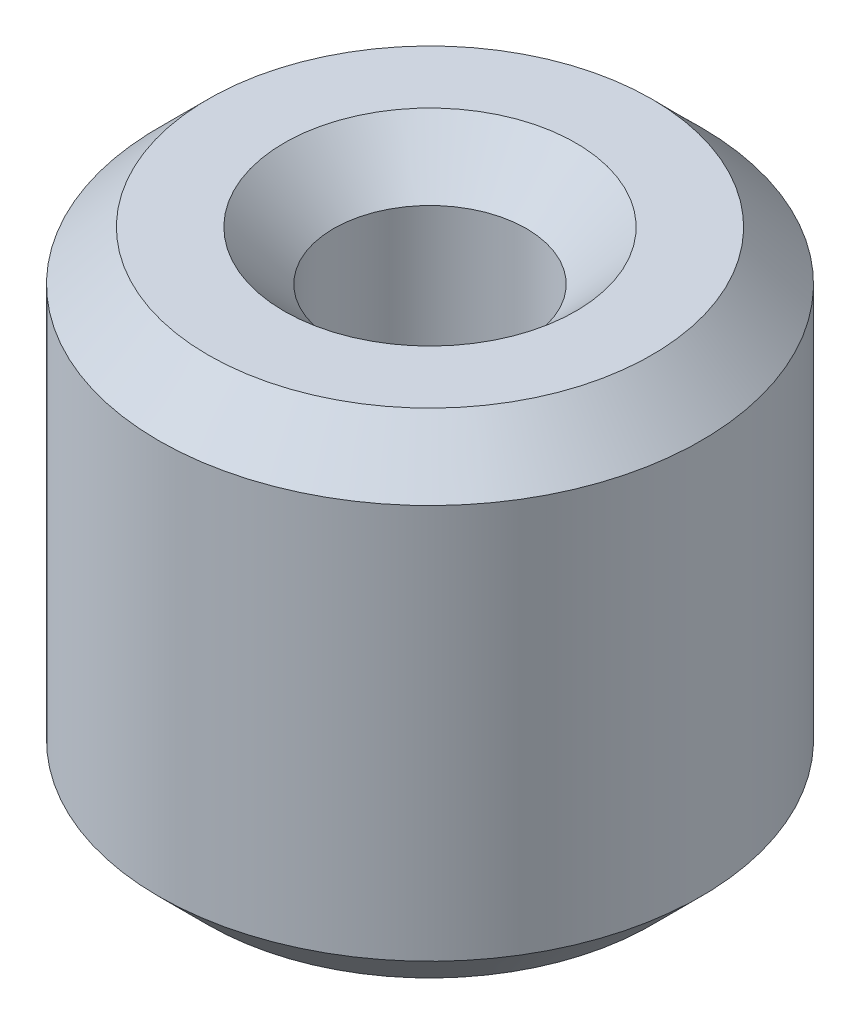
ISO-10303-21;
HEADER;
FILE_DESCRIPTION(('STEP AP214'),'2;1');
FILE_NAME('part.step','',(''),(''),'','','');
FILE_SCHEMA(('AUTOMOTIVE_DESIGN { 1 0 10303 214 1 1 1 1 }'));
ENDSEC;
DATA;
#1=APPLICATION_CONTEXT('core data for automotive mechanical design processes');
#2=APPLICATION_PROTOCOL_DEFINITION('international standard','automotive_design',2000,#1);
#3=PRODUCT_CONTEXT('',#1,'mechanical');
#4=PRODUCT('Part','Part','',(#3));
#5=PRODUCT_RELATED_PRODUCT_CATEGORY('part','',(#4));
#6=PRODUCT_DEFINITION_FORMATION('','',#4);
#7=PRODUCT_DEFINITION_CONTEXT('part definition',#1,'design');
#8=PRODUCT_DEFINITION('design','',#6,#7);
#9=PRODUCT_DEFINITION_SHAPE('','',#8);
#10=(LENGTH_UNIT() NAMED_UNIT(*) SI_UNIT(.MILLI.,.METRE.));
#11=(NAMED_UNIT(*) PLANE_ANGLE_UNIT() SI_UNIT($,.RADIAN.));
#12=(NAMED_UNIT(*) SI_UNIT($,.STERADIAN.) SOLID_ANGLE_UNIT());
#13=UNCERTAINTY_MEASURE_WITH_UNIT(LENGTH_MEASURE(1.E-05),#10,'distance_accuracy_value','');
#14=(GEOMETRIC_REPRESENTATION_CONTEXT(3) GLOBAL_UNCERTAINTY_ASSIGNED_CONTEXT((#13)) GLOBAL_UNIT_ASSIGNED_CONTEXT((#10,
#11,#12)) REPRESENTATION_CONTEXT('',''));
#15=CARTESIAN_POINT('',(0.,0.,0.));
#16=DIRECTION('',(0.,0.,1.));
#17=DIRECTION('',(1.,0.,0.));
#18=AXIS2_PLACEMENT_3D('',#15,#16,#17);
#19=CARTESIAN_POINT('',(0.,27.2971135500833,0.));
#20=DIRECTION('',(0.,-1.,0.));
#21=DIRECTION('',(0.,0.,-1.));
#22=AXIS2_PLACEMENT_3D('',#19,#20,#21);
#23=CYLINDRICAL_SURFACE('',#22,15.);
#24=CARTESIAN_POINT('',(0.,2.73395472256149,0.));
#25=DIRECTION('',(0.,1.,0.));
#26=DIRECTION('',(0.,0.,1.));
#27=AXIS2_PLACEMENT_3D('',#24,#25,#26);
#28=CIRCLE('',#27,15.);
#29=CARTESIAN_POINT('',(0.,2.73395472256149,15.));
#30=VERTEX_POINT('',#29);
#31=EDGE_CURVE('E10',#30,#30,#28,.T.);
#32=ORIENTED_EDGE('',*,*,#31,.T.);
#33=EDGE_LOOP('',(#32));
#34=FACE_BOUND('',#33,.T.);
#35=CARTESIAN_POINT('',(0.,24.5631588275218,0.));
#36=DIRECTION('',(0.,1.,0.));
#37=DIRECTION('',(0.,0.,1.));
#38=AXIS2_PLACEMENT_3D('',#35,#36,#37);
#39=CIRCLE('',#38,15.);
#40=CARTESIAN_POINT('',(0.,24.5631588275218,15.));
#41=VERTEX_POINT('',#40);
#42=EDGE_CURVE('E50',#41,#41,#39,.F.);
#43=ORIENTED_EDGE('',*,*,#42,.T.);
#44=EDGE_LOOP('',(#43));
#45=FACE_BOUND('',#44,.T.);
#46=ADVANCED_FACE('F39',(#34,#45),#23,.T.);
#47=CARTESIAN_POINT('',(0.,27.2971135500833,0.));
#48=DIRECTION('',(0.,1.,0.));
#49=DIRECTION('',(0.,0.,1.));
#50=AXIS2_PLACEMENT_3D('',#47,#48,#49);
#51=PLANE('',#50);
#52=CARTESIAN_POINT('',(0.,27.2971135500833,0.));
#53=DIRECTION('',(0.,1.,0.));
#54=DIRECTION('',(0.,0.,1.));
#55=AXIS2_PLACEMENT_3D('',#52,#53,#54);
#56=CIRCLE('',#55,8.06329436644079);
#57=CARTESIAN_POINT('',(0.,27.2971135500833,8.06329436644079));
#58=VERTEX_POINT('',#57);
#59=EDGE_CURVE('E58',#58,#58,#56,.F.);
#60=ORIENTED_EDGE('',*,*,#59,.T.);
#61=EDGE_LOOP('',(#60));
#62=FACE_BOUND('',#61,.T.);
#63=CARTESIAN_POINT('',(0.,27.2971135500833,0.));
#64=DIRECTION('',(0.,1.,0.));
#65=DIRECTION('',(0.,0.,1.));
#66=AXIS2_PLACEMENT_3D('',#63,#64,#65);
#67=CIRCLE('',#66,12.2660452774385);
#68=CARTESIAN_POINT('',(0.,27.2971135500833,12.2660452774385));
#69=VERTEX_POINT('',#68);
#70=EDGE_CURVE('E61',#69,#69,#67,.T.);
#71=ORIENTED_EDGE('',*,*,#70,.T.);
#72=EDGE_LOOP('',(#71));
#73=FACE_BOUND('',#72,.T.);
#74=ADVANCED_FACE('F88',(#62,#73),#51,.T.);
#75=CARTESIAN_POINT('',(0.,0.,0.));
#76=DIRECTION('',(0.,1.,0.));
#77=DIRECTION('',(0.,0.,1.));
#78=AXIS2_PLACEMENT_3D('',#75,#76,#77);
#79=PLANE('',#78);
#80=CARTESIAN_POINT('',(0.,0.,0.));
#81=DIRECTION('',(0.,1.,0.));
#82=DIRECTION('',(0.,0.,1.));
#83=AXIS2_PLACEMENT_3D('',#80,#81,#82);
#84=CIRCLE('',#83,8.06329436644078);
#85=CARTESIAN_POINT('',(0.,0.,8.06329436644078));
#86=VERTEX_POINT('',#85);
#87=EDGE_CURVE('E51',#86,#86,#84,.T.);
#88=ORIENTED_EDGE('',*,*,#87,.T.);
#89=EDGE_LOOP('',(#88));
#90=FACE_BOUND('',#89,.T.);
#91=CARTESIAN_POINT('',(0.,0.,0.));
#92=DIRECTION('',(0.,1.,0.));
#93=DIRECTION('',(0.,0.,1.));
#94=AXIS2_PLACEMENT_3D('',#91,#92,#93);
#95=CIRCLE('',#94,12.2660452774385);
#96=CARTESIAN_POINT('',(0.,0.,12.2660452774385));
#97=VERTEX_POINT('',#96);
#98=EDGE_CURVE('E54',#97,#97,#95,.F.);
#99=ORIENTED_EDGE('',*,*,#98,.T.);
#100=EDGE_LOOP('',(#99));
#101=FACE_BOUND('',#100,.T.);
#102=ADVANCED_FACE('F83',(#90,#101),#79,.F.);
#103=CARTESIAN_POINT('',(0.,27.2971135500833,0.));
#104=DIRECTION('',(0.,-1.,0.));
#105=DIRECTION('',(0.,0.,-1.));
#106=AXIS2_PLACEMENT_3D('',#103,#104,#105);
#107=CYLINDRICAL_SURFACE('',#106,5.32933964387929);
#108=CARTESIAN_POINT('',(0.,24.5631588275218,0.));
#109=DIRECTION('',(0.,1.,0.));
#110=DIRECTION('',(0.,0.,1.));
#111=AXIS2_PLACEMENT_3D('',#108,#109,#110);
#112=CIRCLE('',#111,5.32933964387929);
#113=CARTESIAN_POINT('',(0.,24.5631588275218,5.32933964387929));
#114=VERTEX_POINT('',#113);
#115=EDGE_CURVE('E67',#114,#114,#112,.T.);
#116=ORIENTED_EDGE('',*,*,#115,.T.);
#117=EDGE_LOOP('',(#116));
#118=FACE_BOUND('',#117,.T.);
#119=CARTESIAN_POINT('',(0.,2.73395472256151,0.));
#120=DIRECTION('',(0.,1.,0.));
#121=DIRECTION('',(0.,0.,1.));
#122=AXIS2_PLACEMENT_3D('',#119,#120,#121);
#123=CIRCLE('',#122,5.32933964387929);
#124=CARTESIAN_POINT('',(0.,2.73395472256151,5.32933964387929));
#125=VERTEX_POINT('',#124);
#126=EDGE_CURVE('E69',#125,#125,#123,.F.);
#127=ORIENTED_EDGE('',*,*,#126,.T.);
#128=EDGE_LOOP('',(#127));
#129=FACE_BOUND('',#128,.T.);
#130=ADVANCED_FACE('F71',(#118,#129),#107,.F.);
#131=CARTESIAN_POINT('',(0.,24.5631588275218,0.));
#132=DIRECTION('',(0.,1.,0.));
#133=DIRECTION('',(0.,0.,1.));
#134=AXIS2_PLACEMENT_3D('',#131,#132,#133);
#135=CONICAL_SURFACE('',#134,5.32933964387929,0.785398163397451);
#136=ORIENTED_EDGE('',*,*,#59,.F.);
#137=EDGE_LOOP('',(#136));
#138=FACE_BOUND('',#137,.T.);
#139=ORIENTED_EDGE('',*,*,#115,.F.);
#140=EDGE_LOOP('',(#139));
#141=FACE_BOUND('',#140,.T.);
#142=ADVANCED_FACE('F77',(#138,#141),#135,.F.);
#143=CARTESIAN_POINT('',(0.,0.,0.));
#144=DIRECTION('',(0.,-1.,0.));
#145=DIRECTION('',(0.,0.,-1.));
#146=AXIS2_PLACEMENT_3D('',#143,#144,#145);
#147=CONICAL_SURFACE('',#146,8.06329436644078,0.785398163397445);
#148=ORIENTED_EDGE('',*,*,#126,.F.);
#149=EDGE_LOOP('',(#148));
#150=FACE_BOUND('',#149,.T.);
#151=ORIENTED_EDGE('',*,*,#87,.F.);
#152=EDGE_LOOP('',(#151));
#153=FACE_BOUND('',#152,.T.);
#154=ADVANCED_FACE('F73',(#150,#153),#147,.F.);
#155=CARTESIAN_POINT('',(0.,2.73395472256149,0.));
#156=DIRECTION('',(0.,1.,0.));
#157=DIRECTION('',(0.,0.,1.));
#158=AXIS2_PLACEMENT_3D('',#155,#156,#157);
#159=CONICAL_SURFACE('',#158,15.,0.785398163397452);
#160=ORIENTED_EDGE('',*,*,#98,.F.);
#161=EDGE_LOOP('',(#160));
#162=FACE_BOUND('',#161,.T.);
#163=ORIENTED_EDGE('',*,*,#31,.F.);
#164=EDGE_LOOP('',(#163));
#165=FACE_BOUND('',#164,.T.);
#166=ADVANCED_FACE('F76',(#162,#165),#159,.T.);
#167=CARTESIAN_POINT('',(0.,27.2971135500833,0.));
#168=DIRECTION('',(0.,-1.,0.));
#169=DIRECTION('',(0.,0.,-1.));
#170=AXIS2_PLACEMENT_3D('',#167,#168,#169);
#171=CONICAL_SURFACE('',#170,12.2660452774385,0.785398163397445);
#172=ORIENTED_EDGE('',*,*,#42,.F.);
#173=EDGE_LOOP('',(#172));
#174=FACE_BOUND('',#173,.T.);
#175=ORIENTED_EDGE('',*,*,#70,.F.);
#176=EDGE_LOOP('',(#175));
#177=FACE_BOUND('',#176,.T.);
#178=ADVANCED_FACE('F45',(#174,#177),#171,.T.);
#179=CLOSED_SHELL('',(#46,#74,#102,#130,#142,#154,#166,#178));
#180=MANIFOLD_SOLID_BREP('B2',#179);
#181=ADVANCED_BREP_SHAPE_REPRESENTATION('',(#18,#180),#14);
#182=SHAPE_DEFINITION_REPRESENTATION(#9,#181);
ENDSEC;
END-ISO-10303-21;
